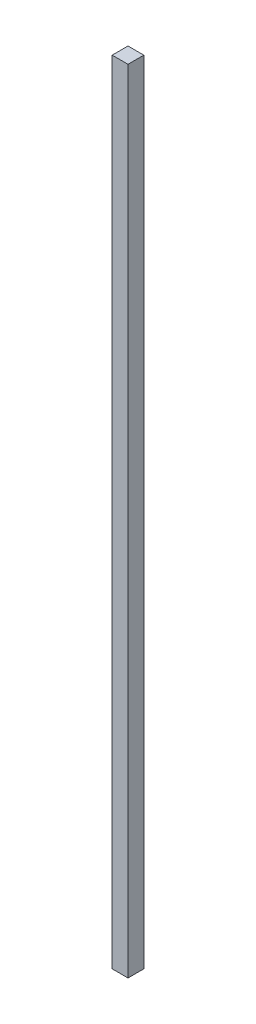
ISO-10303-21;
HEADER;
FILE_DESCRIPTION(('STEP AP214'),'2;1');
FILE_NAME('part.step','',(''),(''),'','','');
FILE_SCHEMA(('AUTOMOTIVE_DESIGN { 1 0 10303 214 1 1 1 1 }'));
ENDSEC;
DATA;
#1=APPLICATION_CONTEXT('core data for automotive mechanical design processes');
#2=APPLICATION_PROTOCOL_DEFINITION('international standard','automotive_design',2000,#1);
#3=PRODUCT_CONTEXT('',#1,'mechanical');
#4=PRODUCT('Part','Part','',(#3));
#5=PRODUCT_RELATED_PRODUCT_CATEGORY('part','',(#4));
#6=PRODUCT_DEFINITION_FORMATION('','',#4);
#7=PRODUCT_DEFINITION_CONTEXT('part definition',#1,'design');
#8=PRODUCT_DEFINITION('design','',#6,#7);
#9=PRODUCT_DEFINITION_SHAPE('','',#8);
#10=(LENGTH_UNIT() NAMED_UNIT(*) SI_UNIT(.MILLI.,.METRE.));
#11=(NAMED_UNIT(*) PLANE_ANGLE_UNIT() SI_UNIT($,.RADIAN.));
#12=(NAMED_UNIT(*) SI_UNIT($,.STERADIAN.) SOLID_ANGLE_UNIT());
#13=UNCERTAINTY_MEASURE_WITH_UNIT(LENGTH_MEASURE(1.E-05),#10,'distance_accuracy_value','');
#14=(GEOMETRIC_REPRESENTATION_CONTEXT(3) GLOBAL_UNCERTAINTY_ASSIGNED_CONTEXT((#13)) GLOBAL_UNIT_ASSIGNED_CONTEXT((#10,
#11,#12)) REPRESENTATION_CONTEXT('',''));
#15=CARTESIAN_POINT('',(0.,0.,0.));
#16=DIRECTION('',(0.,0.,1.));
#17=DIRECTION('',(1.,0.,0.));
#18=AXIS2_PLACEMENT_3D('',#15,#16,#17);
#19=CARTESIAN_POINT('',(-39.8355089835924,1270.,-18.6136158048334));
#20=DIRECTION('',(1.,0.,0.));
#21=DIRECTION('',(0.,0.,-1.));
#22=AXIS2_PLACEMENT_3D('',#19,#20,#21);
#23=PLANE('',#22);
#24=DIRECTION('',(0.,0.,1.));
#25=VECTOR('',#24,1.);
#26=CARTESIAN_POINT('',(-39.8355089835924,0.,-18.6136158048334));
#27=LINE('',#26,#25);
#28=CARTESIAN_POINT('',(-39.8355089835924,0.,-18.6136158048334));
#29=VERTEX_POINT('',#28);
#30=CARTESIAN_POINT('',(-39.8355089835924,0.,6.78638419516663));
#31=VERTEX_POINT('',#30);
#32=EDGE_CURVE('E94',#29,#31,#27,.T.);
#33=ORIENTED_EDGE('',*,*,#32,.T.);
#34=DIRECTION('',(0.,-1.,0.));
#35=VECTOR('',#34,1.);
#36=CARTESIAN_POINT('',(-39.8355089835924,1270.,6.78638419516663));
#37=LINE('',#36,#35);
#38=CARTESIAN_POINT('',(-39.8355089835924,1270.,6.78638419516663));
#39=VERTEX_POINT('',#38);
#40=EDGE_CURVE('E11',#39,#31,#37,.T.);
#41=ORIENTED_EDGE('',*,*,#40,.F.);
#42=DIRECTION('',(0.,0.,1.));
#43=VECTOR('',#42,1.);
#44=CARTESIAN_POINT('',(-39.8355089835924,1270.,-18.6136158048334));
#45=LINE('',#44,#43);
#46=CARTESIAN_POINT('',(-39.8355089835924,1270.,-18.6136158048334));
#47=VERTEX_POINT('',#46);
#48=EDGE_CURVE('E82',#47,#39,#45,.T.);
#49=ORIENTED_EDGE('',*,*,#48,.F.);
#50=DIRECTION('',(0.,-1.,0.));
#51=VECTOR('',#50,1.);
#52=CARTESIAN_POINT('',(-39.8355089835924,1270.,-18.6136158048334));
#53=LINE('',#52,#51);
#54=EDGE_CURVE('E90',#47,#29,#53,.T.);
#55=ORIENTED_EDGE('',*,*,#54,.T.);
#56=EDGE_LOOP('',(#33,#41,#49,#55));
#57=FACE_BOUND('',#56,.T.);
#58=ADVANCED_FACE('F31',(#57),#23,.F.);
#59=CARTESIAN_POINT('',(-39.8355089835924,1270.,6.78638419516663));
#60=DIRECTION('',(0.,0.,-1.));
#61=DIRECTION('',(-1.,0.,0.));
#62=AXIS2_PLACEMENT_3D('',#59,#60,#61);
#63=PLANE('',#62);
#64=DIRECTION('',(1.,0.,0.));
#65=VECTOR('',#64,1.);
#66=CARTESIAN_POINT('',(-39.8355089835924,0.,6.78638419516663));
#67=LINE('',#66,#65);
#68=CARTESIAN_POINT('',(-14.4355089835924,0.,6.78638419516663));
#69=VERTEX_POINT('',#68);
#70=EDGE_CURVE('E86',#31,#69,#67,.T.);
#71=ORIENTED_EDGE('',*,*,#70,.T.);
#72=DIRECTION('',(0.,-1.,0.));
#73=VECTOR('',#72,1.);
#74=CARTESIAN_POINT('',(-14.4355089835924,1270.,6.78638419516663));
#75=LINE('',#74,#73);
#76=CARTESIAN_POINT('',(-14.4355089835924,1270.,6.78638419516663));
#77=VERTEX_POINT('',#76);
#78=EDGE_CURVE('E39',#77,#69,#75,.T.);
#79=ORIENTED_EDGE('',*,*,#78,.F.);
#80=DIRECTION('',(1.,0.,0.));
#81=VECTOR('',#80,1.);
#82=CARTESIAN_POINT('',(-39.8355089835924,1270.,6.78638419516663));
#83=LINE('',#82,#81);
#84=EDGE_CURVE('E77',#39,#77,#83,.T.);
#85=ORIENTED_EDGE('',*,*,#84,.F.);
#86=ORIENTED_EDGE('',*,*,#40,.T.);
#87=EDGE_LOOP('',(#71,#79,#85,#86));
#88=FACE_BOUND('',#87,.T.);
#89=ADVANCED_FACE('F85',(#88),#63,.F.);
#90=CARTESIAN_POINT('',(-14.4355089835924,1270.,-18.6136158048334));
#91=DIRECTION('',(-1.,0.,0.));
#92=DIRECTION('',(0.,0.,1.));
#93=AXIS2_PLACEMENT_3D('',#90,#91,#92);
#94=PLANE('',#93);
#95=DIRECTION('',(0.,0.,-1.));
#96=VECTOR('',#95,1.);
#97=CARTESIAN_POINT('',(-14.4355089835924,0.,-18.6136158048334));
#98=LINE('',#97,#96);
#99=CARTESIAN_POINT('',(-14.4355089835924,0.,-18.6136158048334));
#100=VERTEX_POINT('',#99);
#101=EDGE_CURVE('E64',#69,#100,#98,.T.);
#102=ORIENTED_EDGE('',*,*,#101,.T.);
#103=DIRECTION('',(0.,-1.,0.));
#104=VECTOR('',#103,1.);
#105=CARTESIAN_POINT('',(-14.4355089835924,1270.,-18.6136158048334));
#106=LINE('',#105,#104);
#107=CARTESIAN_POINT('',(-14.4355089835924,1270.,-18.6136158048334));
#108=VERTEX_POINT('',#107);
#109=EDGE_CURVE('E87',#108,#100,#106,.T.);
#110=ORIENTED_EDGE('',*,*,#109,.F.);
#111=DIRECTION('',(0.,0.,-1.));
#112=VECTOR('',#111,1.);
#113=CARTESIAN_POINT('',(-14.4355089835924,1270.,-18.6136158048334));
#114=LINE('',#113,#112);
#115=EDGE_CURVE('E80',#77,#108,#114,.T.);
#116=ORIENTED_EDGE('',*,*,#115,.F.);
#117=ORIENTED_EDGE('',*,*,#78,.T.);
#118=EDGE_LOOP('',(#102,#110,#116,#117));
#119=FACE_BOUND('',#118,.T.);
#120=ADVANCED_FACE('F88',(#119),#94,.F.);
#121=CARTESIAN_POINT('',(-39.8355089835924,1270.,-18.6136158048334));
#122=DIRECTION('',(0.,0.,1.));
#123=DIRECTION('',(1.,0.,0.));
#124=AXIS2_PLACEMENT_3D('',#121,#122,#123);
#125=PLANE('',#124);
#126=DIRECTION('',(-1.,0.,0.));
#127=VECTOR('',#126,1.);
#128=CARTESIAN_POINT('',(-39.8355089835924,0.,-18.6136158048334));
#129=LINE('',#128,#127);
#130=EDGE_CURVE('E70',#100,#29,#129,.T.);
#131=ORIENTED_EDGE('',*,*,#130,.T.);
#132=ORIENTED_EDGE('',*,*,#54,.F.);
#133=DIRECTION('',(-1.,0.,0.));
#134=VECTOR('',#133,1.);
#135=CARTESIAN_POINT('',(-39.8355089835924,1270.,-18.6136158048334));
#136=LINE('',#135,#134);
#137=EDGE_CURVE('E47',#108,#47,#136,.T.);
#138=ORIENTED_EDGE('',*,*,#137,.F.);
#139=ORIENTED_EDGE('',*,*,#109,.T.);
#140=EDGE_LOOP('',(#131,#132,#138,#139));
#141=FACE_BOUND('',#140,.T.);
#142=ADVANCED_FACE('F101',(#141),#125,.F.);
#143=CARTESIAN_POINT('',(-39.8355089835924,1270.,6.78638419516663));
#144=DIRECTION('',(0.,1.,0.));
#145=DIRECTION('',(0.,0.,1.));
#146=AXIS2_PLACEMENT_3D('',#143,#144,#145);
#147=PLANE('',#146);
#148=ORIENTED_EDGE('',*,*,#48,.T.);
#149=ORIENTED_EDGE('',*,*,#84,.T.);
#150=ORIENTED_EDGE('',*,*,#115,.T.);
#151=ORIENTED_EDGE('',*,*,#137,.T.);
#152=EDGE_LOOP('',(#148,#149,#150,#151));
#153=FACE_BOUND('',#152,.T.);
#154=ADVANCED_FACE('F78',(#153),#147,.T.);
#155=CARTESIAN_POINT('',(-39.8355089835924,0.,6.78638419516663));
#156=DIRECTION('',(0.,1.,0.));
#157=DIRECTION('',(0.,0.,1.));
#158=AXIS2_PLACEMENT_3D('',#155,#156,#157);
#159=PLANE('',#158);
#160=ORIENTED_EDGE('',*,*,#32,.F.);
#161=ORIENTED_EDGE('',*,*,#130,.F.);
#162=ORIENTED_EDGE('',*,*,#101,.F.);
#163=ORIENTED_EDGE('',*,*,#70,.F.);
#164=EDGE_LOOP('',(#160,#161,#162,#163));
#165=FACE_BOUND('',#164,.T.);
#166=ADVANCED_FACE('F104',(#165),#159,.F.);
#167=CLOSED_SHELL('',(#58,#89,#120,#142,#154,#166));
#168=MANIFOLD_SOLID_BREP('B2',#167);
#169=ADVANCED_BREP_SHAPE_REPRESENTATION('',(#18,#168),#14);
#170=SHAPE_DEFINITION_REPRESENTATION(#9,#169);
ENDSEC;
END-ISO-10303-21;
